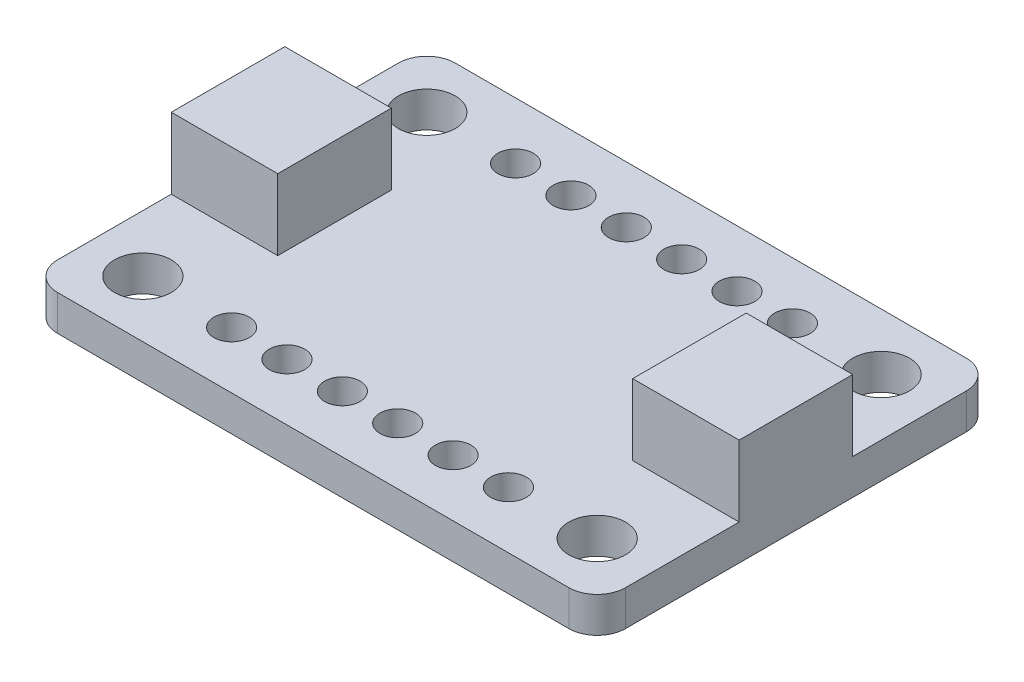
ISO-10303-21;
HEADER;
FILE_DESCRIPTION(('STEP AP214'),'2;1');
FILE_NAME('part.step','',(''),(''),'','','');
FILE_SCHEMA(('AUTOMOTIVE_DESIGN { 1 0 10303 214 1 1 1 1 }'));
ENDSEC;
DATA;
#1=APPLICATION_CONTEXT('core data for automotive mechanical design processes');
#2=APPLICATION_PROTOCOL_DEFINITION('international standard','automotive_design',2000,#1);
#3=PRODUCT_CONTEXT('',#1,'mechanical');
#4=PRODUCT('Part','Part','',(#3));
#5=PRODUCT_RELATED_PRODUCT_CATEGORY('part','',(#4));
#6=PRODUCT_DEFINITION_FORMATION('','',#4);
#7=PRODUCT_DEFINITION_CONTEXT('part definition',#1,'design');
#8=PRODUCT_DEFINITION('design','',#6,#7);
#9=PRODUCT_DEFINITION_SHAPE('','',#8);
#10=(LENGTH_UNIT() NAMED_UNIT(*) SI_UNIT(.MILLI.,.METRE.));
#11=(NAMED_UNIT(*) PLANE_ANGLE_UNIT() SI_UNIT($,.RADIAN.));
#12=(NAMED_UNIT(*) SI_UNIT($,.STERADIAN.) SOLID_ANGLE_UNIT());
#13=UNCERTAINTY_MEASURE_WITH_UNIT(LENGTH_MEASURE(1.E-05),#10,'distance_accuracy_value','');
#14=(GEOMETRIC_REPRESENTATION_CONTEXT(3) GLOBAL_UNCERTAINTY_ASSIGNED_CONTEXT((#13)) GLOBAL_UNIT_ASSIGNED_CONTEXT((#10,
#11,#12)) REPRESENTATION_CONTEXT('',''));
#15=CARTESIAN_POINT('',(0.,0.,0.));
#16=DIRECTION('',(0.,0.,1.));
#17=DIRECTION('',(1.,0.,0.));
#18=AXIS2_PLACEMENT_3D('',#15,#16,#17);
#19=CARTESIAN_POINT('',(1.27,1.5875,-16.51));
#20=DIRECTION('',(0.,-1.,0.));
#21=DIRECTION('',(0.,0.,-1.));
#22=AXIS2_PLACEMENT_3D('',#19,#20,#21);
#23=PLANE('',#22);
#24=CARTESIAN_POINT('',(11.46175,1.5875,-15.24));
#25=DIRECTION('',(0.,1.,0.));
#26=DIRECTION('',(0.,0.,1.));
#27=AXIS2_PLACEMENT_3D('',#24,#25,#26);
#28=CIRCLE('',#27,0.793749999999999);
#29=CARTESIAN_POINT('',(11.46175,1.5875,-14.44625));
#30=VERTEX_POINT('',#29);
#31=EDGE_CURVE('E244',#30,#30,#28,.T.);
#32=ORIENTED_EDGE('',*,*,#31,.F.);
#33=EDGE_LOOP('',(#32));
#34=FACE_BOUND('',#33,.T.);
#35=CARTESIAN_POINT('',(13.93825,1.5875,-15.24));
#36=DIRECTION('',(0.,1.,0.));
#37=DIRECTION('',(0.,0.,1.));
#38=AXIS2_PLACEMENT_3D('',#35,#36,#37);
#39=CIRCLE('',#38,0.793749999999999);
#40=CARTESIAN_POINT('',(13.93825,1.5875,-14.44625));
#41=VERTEX_POINT('',#40);
#42=EDGE_CURVE('E238',#41,#41,#39,.T.);
#43=ORIENTED_EDGE('',*,*,#42,.F.);
#44=EDGE_LOOP('',(#43));
#45=FACE_BOUND('',#44,.T.);
#46=CARTESIAN_POINT('',(16.41475,1.5875,-15.24));
#47=DIRECTION('',(0.,1.,0.));
#48=DIRECTION('',(0.,0.,1.));
#49=AXIS2_PLACEMENT_3D('',#46,#47,#48);
#50=CIRCLE('',#49,0.793749999999999);
#51=CARTESIAN_POINT('',(16.41475,1.5875,-14.44625));
#52=VERTEX_POINT('',#51);
#53=EDGE_CURVE('E232',#52,#52,#50,.T.);
#54=ORIENTED_EDGE('',*,*,#53,.F.);
#55=EDGE_LOOP('',(#54));
#56=FACE_BOUND('',#55,.T.);
#57=CARTESIAN_POINT('',(18.89125,1.5875,-2.54));
#58=DIRECTION('',(0.,1.,0.));
#59=DIRECTION('',(0.,0.,1.));
#60=AXIS2_PLACEMENT_3D('',#57,#58,#59);
#61=CIRCLE('',#60,0.793749999999999);
#62=CARTESIAN_POINT('',(18.89125,1.5875,-1.74625));
#63=VERTEX_POINT('',#62);
#64=EDGE_CURVE('E225',#63,#63,#61,.T.);
#65=ORIENTED_EDGE('',*,*,#64,.F.);
#66=EDGE_LOOP('',(#65));
#67=FACE_BOUND('',#66,.T.);
#68=CARTESIAN_POINT('',(16.41475,1.5875,-2.54));
#69=DIRECTION('',(0.,1.,0.));
#70=DIRECTION('',(0.,0.,1.));
#71=AXIS2_PLACEMENT_3D('',#68,#69,#70);
#72=CIRCLE('',#71,0.793749999999999);
#73=CARTESIAN_POINT('',(16.41475,1.5875,-1.74625));
#74=VERTEX_POINT('',#73);
#75=EDGE_CURVE('E268',#74,#74,#72,.T.);
#76=ORIENTED_EDGE('',*,*,#75,.F.);
#77=EDGE_LOOP('',(#76));
#78=FACE_BOUND('',#77,.T.);
#79=CARTESIAN_POINT('',(13.93825,1.5875,-2.54));
#80=DIRECTION('',(0.,1.,0.));
#81=DIRECTION('',(0.,0.,1.));
#82=AXIS2_PLACEMENT_3D('',#79,#80,#81);
#83=CIRCLE('',#82,0.793749999999999);
#84=CARTESIAN_POINT('',(13.93825,1.5875,-1.74625));
#85=VERTEX_POINT('',#84);
#86=EDGE_CURVE('E262',#85,#85,#83,.T.);
#87=ORIENTED_EDGE('',*,*,#86,.F.);
#88=EDGE_LOOP('',(#87));
#89=FACE_BOUND('',#88,.T.);
#90=CARTESIAN_POINT('',(11.46175,1.5875,-2.54));
#91=DIRECTION('',(0.,1.,0.));
#92=DIRECTION('',(0.,0.,1.));
#93=AXIS2_PLACEMENT_3D('',#90,#91,#92);
#94=CIRCLE('',#93,0.793749999999999);
#95=CARTESIAN_POINT('',(11.46175,1.5875,-1.74625));
#96=VERTEX_POINT('',#95);
#97=EDGE_CURVE('E256',#96,#96,#94,.T.);
#98=ORIENTED_EDGE('',*,*,#97,.F.);
#99=EDGE_LOOP('',(#98));
#100=FACE_BOUND('',#99,.T.);
#101=CARTESIAN_POINT('',(8.98525,1.5875,-2.54));
#102=DIRECTION('',(0.,1.,0.));
#103=DIRECTION('',(0.,0.,1.));
#104=AXIS2_PLACEMENT_3D('',#101,#102,#103);
#105=CIRCLE('',#104,0.793749999999999);
#106=CARTESIAN_POINT('',(8.98525,1.5875,-1.74625));
#107=VERTEX_POINT('',#106);
#108=EDGE_CURVE('E249',#107,#107,#105,.T.);
#109=ORIENTED_EDGE('',*,*,#108,.F.);
#110=EDGE_LOOP('',(#109));
#111=FACE_BOUND('',#110,.T.);
#112=CARTESIAN_POINT('',(8.98525,1.5875,-15.24));
#113=DIRECTION('',(0.,1.,0.));
#114=DIRECTION('',(0.,0.,1.));
#115=AXIS2_PLACEMENT_3D('',#112,#113,#114);
#116=CIRCLE('',#115,0.793749999999999);
#117=CARTESIAN_POINT('',(8.98525,1.5875,-14.44625));
#118=VERTEX_POINT('',#117);
#119=EDGE_CURVE('E207',#118,#118,#116,.T.);
#120=ORIENTED_EDGE('',*,*,#119,.F.);
#121=EDGE_LOOP('',(#120));
#122=FACE_BOUND('',#121,.T.);
#123=CARTESIAN_POINT('',(6.50875,1.5875,-15.24));
#124=DIRECTION('',(0.,1.,0.));
#125=DIRECTION('',(0.,0.,1.));
#126=AXIS2_PLACEMENT_3D('',#123,#124,#125);
#127=CIRCLE('',#126,0.79375);
#128=CARTESIAN_POINT('',(6.50875,1.5875,-14.44625));
#129=VERTEX_POINT('',#128);
#130=EDGE_CURVE('E214',#129,#129,#127,.T.);
#131=ORIENTED_EDGE('',*,*,#130,.F.);
#132=EDGE_LOOP('',(#131));
#133=FACE_BOUND('',#132,.T.);
#134=CARTESIAN_POINT('',(18.89125,1.5875,-15.24));
#135=DIRECTION('',(0.,1.,0.));
#136=DIRECTION('',(0.,0.,1.));
#137=AXIS2_PLACEMENT_3D('',#134,#135,#136);
#138=CIRCLE('',#137,0.793749999999999);
#139=CARTESIAN_POINT('',(18.89125,1.5875,-14.44625));
#140=VERTEX_POINT('',#139);
#141=EDGE_CURVE('E220',#140,#140,#138,.T.);
#142=ORIENTED_EDGE('',*,*,#141,.F.);
#143=EDGE_LOOP('',(#142));
#144=FACE_BOUND('',#143,.T.);
#145=CARTESIAN_POINT('',(6.50875,1.5875,-2.54));
#146=DIRECTION('',(0.,1.,0.));
#147=DIRECTION('',(0.,0.,1.));
#148=AXIS2_PLACEMENT_3D('',#145,#146,#147);
#149=CIRCLE('',#148,0.79375);
#150=CARTESIAN_POINT('',(6.50875,1.5875,-1.74625));
#151=VERTEX_POINT('',#150);
#152=EDGE_CURVE('E252',#151,#151,#149,.T.);
#153=ORIENTED_EDGE('',*,*,#152,.F.);
#154=EDGE_LOOP('',(#153));
#155=FACE_BOUND('',#154,.T.);
#156=CARTESIAN_POINT('',(2.54,1.5875,-15.24));
#157=DIRECTION('',(0.,1.,0.));
#158=DIRECTION('',(0.,0.,1.));
#159=AXIS2_PLACEMENT_3D('',#156,#157,#158);
#160=CIRCLE('',#159,1.27);
#161=CARTESIAN_POINT('',(2.54,1.5875,-13.97));
#162=VERTEX_POINT('',#161);
#163=EDGE_CURVE('E297',#162,#162,#160,.T.);
#164=ORIENTED_EDGE('',*,*,#163,.F.);
#165=EDGE_LOOP('',(#164));
#166=FACE_BOUND('',#165,.T.);
#167=CARTESIAN_POINT('',(22.86,1.5875,-15.24));
#168=DIRECTION('',(0.,1.,0.));
#169=DIRECTION('',(0.,0.,1.));
#170=AXIS2_PLACEMENT_3D('',#167,#168,#169);
#171=CIRCLE('',#170,1.27);
#172=CARTESIAN_POINT('',(22.86,1.5875,-13.97));
#173=VERTEX_POINT('',#172);
#174=EDGE_CURVE('E291',#173,#173,#171,.T.);
#175=ORIENTED_EDGE('',*,*,#174,.F.);
#176=EDGE_LOOP('',(#175));
#177=FACE_BOUND('',#176,.T.);
#178=CARTESIAN_POINT('',(22.86,1.5875,-2.54));
#179=DIRECTION('',(0.,1.,0.));
#180=DIRECTION('',(0.,0.,1.));
#181=AXIS2_PLACEMENT_3D('',#178,#179,#180);
#182=CIRCLE('',#181,1.27);
#183=CARTESIAN_POINT('',(22.86,1.5875,-1.27));
#184=VERTEX_POINT('',#183);
#185=EDGE_CURVE('E285',#184,#184,#182,.T.);
#186=ORIENTED_EDGE('',*,*,#185,.F.);
#187=EDGE_LOOP('',(#186));
#188=FACE_BOUND('',#187,.T.);
#189=CARTESIAN_POINT('',(2.54,1.5875,-2.54));
#190=DIRECTION('',(0.,1.,0.));
#191=DIRECTION('',(0.,0.,1.));
#192=AXIS2_PLACEMENT_3D('',#189,#190,#191);
#193=CIRCLE('',#192,1.27);
#194=CARTESIAN_POINT('',(2.54,1.5875,-1.27));
#195=VERTEX_POINT('',#194);
#196=EDGE_CURVE('E279',#195,#195,#193,.T.);
#197=ORIENTED_EDGE('',*,*,#196,.F.);
#198=EDGE_LOOP('',(#197));
#199=FACE_BOUND('',#198,.T.);
#200=DIRECTION('',(1.,0.,0.));
#201=VECTOR('',#200,1.);
#202=CARTESIAN_POINT('',(0.,1.5875,-6.35));
#203=LINE('',#202,#201);
#204=CARTESIAN_POINT('',(0.,1.5875,-6.35));
#205=VERTEX_POINT('',#204);
#206=CARTESIAN_POINT('',(4.7625,1.5875,-6.35));
#207=VERTEX_POINT('',#206);
#208=EDGE_CURVE('E376',#205,#207,#203,.T.);
#209=ORIENTED_EDGE('',*,*,#208,.F.);
#210=DIRECTION('',(0.,0.,1.));
#211=VECTOR('',#210,1.);
#212=CARTESIAN_POINT('',(0.,1.5875,-1.27));
#213=LINE('',#212,#211);
#214=CARTESIAN_POINT('',(0.,1.5875,-1.27));
#215=VERTEX_POINT('',#214);
#216=EDGE_CURVE('E170',#205,#215,#213,.T.);
#217=ORIENTED_EDGE('',*,*,#216,.T.);
#218=CARTESIAN_POINT('',(1.27,1.5875,-1.27));
#219=DIRECTION('',(0.,1.,0.));
#220=DIRECTION('',(0.,0.,1.));
#221=AXIS2_PLACEMENT_3D('',#218,#219,#220);
#222=CIRCLE('',#221,1.27);
#223=CARTESIAN_POINT('',(1.27,1.5875,0.));
#224=VERTEX_POINT('',#223);
#225=EDGE_CURVE('E309',#215,#224,#222,.T.);
#226=ORIENTED_EDGE('',*,*,#225,.T.);
#227=DIRECTION('',(1.,0.,0.));
#228=VECTOR('',#227,1.);
#229=CARTESIAN_POINT('',(1.27,1.5875,0.));
#230=LINE('',#229,#228);
#231=CARTESIAN_POINT('',(24.13,1.5875,0.));
#232=VERTEX_POINT('',#231);
#233=EDGE_CURVE('E311',#224,#232,#230,.T.);
#234=ORIENTED_EDGE('',*,*,#233,.T.);
#235=CARTESIAN_POINT('',(24.13,1.5875,-1.27));
#236=DIRECTION('',(0.,1.,0.));
#237=DIRECTION('',(0.,0.,1.));
#238=AXIS2_PLACEMENT_3D('',#235,#236,#237);
#239=CIRCLE('',#238,1.27);
#240=CARTESIAN_POINT('',(25.4,1.5875,-1.27));
#241=VERTEX_POINT('',#240);
#242=EDGE_CURVE('E313',#232,#241,#239,.T.);
#243=ORIENTED_EDGE('',*,*,#242,.T.);
#244=DIRECTION('',(0.,0.,-1.));
#245=VECTOR('',#244,1.);
#246=CARTESIAN_POINT('',(25.4,1.5875,-1.27));
#247=LINE('',#246,#245);
#248=CARTESIAN_POINT('',(25.4,1.5875,-6.35));
#249=VERTEX_POINT('',#248);
#250=EDGE_CURVE('E316',#241,#249,#247,.T.);
#251=ORIENTED_EDGE('',*,*,#250,.T.);
#252=DIRECTION('',(1.,0.,0.));
#253=VECTOR('',#252,1.);
#254=CARTESIAN_POINT('',(25.4,1.5875,-6.35));
#255=LINE('',#254,#253);
#256=CARTESIAN_POINT('',(20.6375,1.5875,-6.35));
#257=VERTEX_POINT('',#256);
#258=EDGE_CURVE('E184',#257,#249,#255,.T.);
#259=ORIENTED_EDGE('',*,*,#258,.F.);
#260=DIRECTION('',(0.,0.,1.));
#261=VECTOR('',#260,1.);
#262=CARTESIAN_POINT('',(20.6375,1.5875,-6.35));
#263=LINE('',#262,#261);
#264=CARTESIAN_POINT('',(20.6375,1.5875,-11.43));
#265=VERTEX_POINT('',#264);
#266=EDGE_CURVE('E174',#265,#257,#263,.T.);
#267=ORIENTED_EDGE('',*,*,#266,.F.);
#268=DIRECTION('',(-1.,0.,0.));
#269=VECTOR('',#268,1.);
#270=CARTESIAN_POINT('',(25.4,1.5875,-11.43));
#271=LINE('',#270,#269);
#272=CARTESIAN_POINT('',(25.4,1.5875,-11.43));
#273=VERTEX_POINT('',#272);
#274=EDGE_CURVE('E171',#273,#265,#271,.T.);
#275=ORIENTED_EDGE('',*,*,#274,.F.);
#276=CARTESIAN_POINT('',(25.4,1.5875,-16.51));
#277=VERTEX_POINT('',#276);
#278=EDGE_CURVE('E315',#273,#277,#247,.T.);
#279=ORIENTED_EDGE('',*,*,#278,.T.);
#280=CARTESIAN_POINT('',(24.13,1.5875,-16.51));
#281=DIRECTION('',(0.,1.,0.));
#282=DIRECTION('',(0.,0.,1.));
#283=AXIS2_PLACEMENT_3D('',#280,#281,#282);
#284=CIRCLE('',#283,1.27);
#285=CARTESIAN_POINT('',(24.13,1.5875,-17.78));
#286=VERTEX_POINT('',#285);
#287=EDGE_CURVE('E318',#277,#286,#284,.T.);
#288=ORIENTED_EDGE('',*,*,#287,.T.);
#289=DIRECTION('',(-1.,0.,0.));
#290=VECTOR('',#289,1.);
#291=CARTESIAN_POINT('',(1.27,1.5875,-17.78));
#292=LINE('',#291,#290);
#293=CARTESIAN_POINT('',(1.27,1.5875,-17.78));
#294=VERTEX_POINT('',#293);
#295=EDGE_CURVE('E320',#286,#294,#292,.T.);
#296=ORIENTED_EDGE('',*,*,#295,.T.);
#297=CARTESIAN_POINT('',(1.27,1.5875,-16.51));
#298=DIRECTION('',(0.,1.,0.));
#299=DIRECTION('',(0.,0.,-1.));
#300=AXIS2_PLACEMENT_3D('',#297,#298,#299);
#301=CIRCLE('',#300,1.27);
#302=CARTESIAN_POINT('',(0.,1.5875,-16.51));
#303=VERTEX_POINT('',#302);
#304=EDGE_CURVE('E303',#294,#303,#301,.T.);
#305=ORIENTED_EDGE('',*,*,#304,.T.);
#306=CARTESIAN_POINT('',(0.,1.5875,-11.43));
#307=VERTEX_POINT('',#306);
#308=EDGE_CURVE('E307',#303,#307,#213,.T.);
#309=ORIENTED_EDGE('',*,*,#308,.T.);
#310=DIRECTION('',(-1.,0.,0.));
#311=VECTOR('',#310,1.);
#312=CARTESIAN_POINT('',(0.,1.5875,-11.43));
#313=LINE('',#312,#311);
#314=CARTESIAN_POINT('',(4.7625,1.5875,-11.43));
#315=VERTEX_POINT('',#314);
#316=EDGE_CURVE('E56',#315,#307,#313,.T.);
#317=ORIENTED_EDGE('',*,*,#316,.F.);
#318=DIRECTION('',(0.,0.,-1.));
#319=VECTOR('',#318,1.);
#320=CARTESIAN_POINT('',(4.7625,1.5875,-6.35));
#321=LINE('',#320,#319);
#322=EDGE_CURVE('E51',#207,#315,#321,.T.);
#323=ORIENTED_EDGE('',*,*,#322,.F.);
#324=EDGE_LOOP('',(#209,#217,#226,#234,#243,#251,#259,#267,#275,#279,#288,#296,#305,#309,#317,#323));
#325=FACE_BOUND('',#324,.T.);
#326=ADVANCED_FACE('F36',(#34,#45,#56,#67,#78,#89,#100,#111,#122,#133,#144,#155,#166,#177,#188,
#199,#325),#23,.F.);
#327=CARTESIAN_POINT('',(1.27,0.,-16.51));
#328=DIRECTION('',(0.,-1.,0.));
#329=DIRECTION('',(0.,0.,-1.));
#330=AXIS2_PLACEMENT_3D('',#327,#328,#329);
#331=PLANE('',#330);
#332=CARTESIAN_POINT('',(11.46175,0.,-15.24));
#333=DIRECTION('',(0.,1.,0.));
#334=DIRECTION('',(0.,0.,1.));
#335=AXIS2_PLACEMENT_3D('',#332,#333,#334);
#336=CIRCLE('',#335,0.793749999999999);
#337=CARTESIAN_POINT('',(11.46175,0.,-14.44625));
#338=VERTEX_POINT('',#337);
#339=EDGE_CURVE('E210',#338,#338,#336,.T.);
#340=ORIENTED_EDGE('',*,*,#339,.T.);
#341=EDGE_LOOP('',(#340));
#342=FACE_BOUND('',#341,.T.);
#343=CARTESIAN_POINT('',(13.93825,0.,-15.24));
#344=DIRECTION('',(0.,1.,0.));
#345=DIRECTION('',(0.,0.,1.));
#346=AXIS2_PLACEMENT_3D('',#343,#344,#345);
#347=CIRCLE('',#346,0.793749999999999);
#348=CARTESIAN_POINT('',(13.93825,0.,-14.44625));
#349=VERTEX_POINT('',#348);
#350=EDGE_CURVE('E241',#349,#349,#347,.T.);
#351=ORIENTED_EDGE('',*,*,#350,.T.);
#352=EDGE_LOOP('',(#351));
#353=FACE_BOUND('',#352,.T.);
#354=CARTESIAN_POINT('',(16.41475,0.,-15.24));
#355=DIRECTION('',(0.,1.,0.));
#356=DIRECTION('',(0.,0.,1.));
#357=AXIS2_PLACEMENT_3D('',#354,#355,#356);
#358=CIRCLE('',#357,0.793749999999999);
#359=CARTESIAN_POINT('',(16.41475,0.,-14.44625));
#360=VERTEX_POINT('',#359);
#361=EDGE_CURVE('E235',#360,#360,#358,.T.);
#362=ORIENTED_EDGE('',*,*,#361,.T.);
#363=EDGE_LOOP('',(#362));
#364=FACE_BOUND('',#363,.T.);
#365=CARTESIAN_POINT('',(18.89125,0.,-2.54));
#366=DIRECTION('',(0.,1.,0.));
#367=DIRECTION('',(0.,0.,1.));
#368=AXIS2_PLACEMENT_3D('',#365,#366,#367);
#369=CIRCLE('',#368,0.793749999999999);
#370=CARTESIAN_POINT('',(18.89125,0.,-1.74625));
#371=VERTEX_POINT('',#370);
#372=EDGE_CURVE('E229',#371,#371,#369,.T.);
#373=ORIENTED_EDGE('',*,*,#372,.T.);
#374=EDGE_LOOP('',(#373));
#375=FACE_BOUND('',#374,.T.);
#376=CARTESIAN_POINT('',(16.41475,0.,-2.54));
#377=DIRECTION('',(0.,1.,0.));
#378=DIRECTION('',(0.,0.,1.));
#379=AXIS2_PLACEMENT_3D('',#376,#377,#378);
#380=CIRCLE('',#379,0.793749999999999);
#381=CARTESIAN_POINT('',(16.41475,0.,-1.74625));
#382=VERTEX_POINT('',#381);
#383=EDGE_CURVE('E228',#382,#382,#380,.T.);
#384=ORIENTED_EDGE('',*,*,#383,.T.);
#385=EDGE_LOOP('',(#384));
#386=FACE_BOUND('',#385,.T.);
#387=CARTESIAN_POINT('',(13.93825,0.,-2.54));
#388=DIRECTION('',(0.,1.,0.));
#389=DIRECTION('',(0.,0.,1.));
#390=AXIS2_PLACEMENT_3D('',#387,#388,#389);
#391=CIRCLE('',#390,0.793749999999999);
#392=CARTESIAN_POINT('',(13.93825,0.,-1.74625));
#393=VERTEX_POINT('',#392);
#394=EDGE_CURVE('E265',#393,#393,#391,.T.);
#395=ORIENTED_EDGE('',*,*,#394,.T.);
#396=EDGE_LOOP('',(#395));
#397=FACE_BOUND('',#396,.T.);
#398=CARTESIAN_POINT('',(11.46175,0.,-2.54));
#399=DIRECTION('',(0.,1.,0.));
#400=DIRECTION('',(0.,0.,1.));
#401=AXIS2_PLACEMENT_3D('',#398,#399,#400);
#402=CIRCLE('',#401,0.793749999999999);
#403=CARTESIAN_POINT('',(11.46175,0.,-1.74625));
#404=VERTEX_POINT('',#403);
#405=EDGE_CURVE('E259',#404,#404,#402,.T.);
#406=ORIENTED_EDGE('',*,*,#405,.T.);
#407=EDGE_LOOP('',(#406));
#408=FACE_BOUND('',#407,.T.);
#409=CARTESIAN_POINT('',(8.98525,0.,-2.54));
#410=DIRECTION('',(0.,1.,0.));
#411=DIRECTION('',(0.,0.,1.));
#412=AXIS2_PLACEMENT_3D('',#409,#410,#411);
#413=CIRCLE('',#412,0.793749999999999);
#414=CARTESIAN_POINT('',(8.98525,0.,-1.74625));
#415=VERTEX_POINT('',#414);
#416=EDGE_CURVE('E253',#415,#415,#413,.T.);
#417=ORIENTED_EDGE('',*,*,#416,.T.);
#418=EDGE_LOOP('',(#417));
#419=FACE_BOUND('',#418,.T.);
#420=CARTESIAN_POINT('',(8.98525,0.,-15.24));
#421=DIRECTION('',(0.,1.,0.));
#422=DIRECTION('',(0.,0.,1.));
#423=AXIS2_PLACEMENT_3D('',#420,#421,#422);
#424=CIRCLE('',#423,0.793749999999999);
#425=CARTESIAN_POINT('',(8.98525,0.,-14.44625));
#426=VERTEX_POINT('',#425);
#427=EDGE_CURVE('E211',#426,#426,#424,.T.);
#428=ORIENTED_EDGE('',*,*,#427,.T.);
#429=EDGE_LOOP('',(#428));
#430=FACE_BOUND('',#429,.T.);
#431=CARTESIAN_POINT('',(6.50875,0.,-15.24));
#432=DIRECTION('',(0.,1.,0.));
#433=DIRECTION('',(0.,0.,1.));
#434=AXIS2_PLACEMENT_3D('',#431,#432,#433);
#435=CIRCLE('',#434,0.79375);
#436=CARTESIAN_POINT('',(6.50875,0.,-14.44625));
#437=VERTEX_POINT('',#436);
#438=EDGE_CURVE('E217',#437,#437,#435,.T.);
#439=ORIENTED_EDGE('',*,*,#438,.T.);
#440=EDGE_LOOP('',(#439));
#441=FACE_BOUND('',#440,.T.);
#442=CARTESIAN_POINT('',(18.89125,0.,-15.24));
#443=DIRECTION('',(0.,1.,0.));
#444=DIRECTION('',(0.,0.,1.));
#445=AXIS2_PLACEMENT_3D('',#442,#443,#444);
#446=CIRCLE('',#445,0.793749999999999);
#447=CARTESIAN_POINT('',(18.89125,0.,-14.44625));
#448=VERTEX_POINT('',#447);
#449=EDGE_CURVE('E206',#448,#448,#446,.T.);
#450=ORIENTED_EDGE('',*,*,#449,.T.);
#451=EDGE_LOOP('',(#450));
#452=FACE_BOUND('',#451,.T.);
#453=CARTESIAN_POINT('',(6.50875,0.,-2.54));
#454=DIRECTION('',(0.,1.,0.));
#455=DIRECTION('',(0.,0.,1.));
#456=AXIS2_PLACEMENT_3D('',#453,#454,#455);
#457=CIRCLE('',#456,0.79375);
#458=CARTESIAN_POINT('',(6.50875,0.,-1.74625));
#459=VERTEX_POINT('',#458);
#460=EDGE_CURVE('E273',#459,#459,#457,.T.);
#461=ORIENTED_EDGE('',*,*,#460,.T.);
#462=EDGE_LOOP('',(#461));
#463=FACE_BOUND('',#462,.T.);
#464=CARTESIAN_POINT('',(22.86,0.,-2.54));
#465=DIRECTION('',(0.,1.,0.));
#466=DIRECTION('',(0.,0.,1.));
#467=AXIS2_PLACEMENT_3D('',#464,#465,#466);
#468=CIRCLE('',#467,1.27);
#469=CARTESIAN_POINT('',(22.86,0.,-1.27));
#470=VERTEX_POINT('',#469);
#471=EDGE_CURVE('E282',#470,#470,#468,.T.);
#472=ORIENTED_EDGE('',*,*,#471,.T.);
#473=EDGE_LOOP('',(#472));
#474=FACE_BOUND('',#473,.T.);
#475=CARTESIAN_POINT('',(2.54,0.,-15.24));
#476=DIRECTION('',(0.,1.,0.));
#477=DIRECTION('',(0.,0.,1.));
#478=AXIS2_PLACEMENT_3D('',#475,#476,#477);
#479=CIRCLE('',#478,1.27);
#480=CARTESIAN_POINT('',(2.54,0.,-13.97));
#481=VERTEX_POINT('',#480);
#482=EDGE_CURVE('E294',#481,#481,#479,.T.);
#483=ORIENTED_EDGE('',*,*,#482,.T.);
#484=EDGE_LOOP('',(#483));
#485=FACE_BOUND('',#484,.T.);
#486=CARTESIAN_POINT('',(1.27,0.,-16.51));
#487=DIRECTION('',(0.,1.,0.));
#488=DIRECTION('',(0.,0.,-1.));
#489=AXIS2_PLACEMENT_3D('',#486,#487,#488);
#490=CIRCLE('',#489,1.27);
#491=CARTESIAN_POINT('',(1.27,0.,-17.78));
#492=VERTEX_POINT('',#491);
#493=CARTESIAN_POINT('',(0.,0.,-16.51));
#494=VERTEX_POINT('',#493);
#495=EDGE_CURVE('E300',#492,#494,#490,.T.);
#496=ORIENTED_EDGE('',*,*,#495,.F.);
#497=DIRECTION('',(-1.,0.,0.));
#498=VECTOR('',#497,1.);
#499=CARTESIAN_POINT('',(1.27,0.,-17.78));
#500=LINE('',#499,#498);
#501=CARTESIAN_POINT('',(24.13,0.,-17.78));
#502=VERTEX_POINT('',#501);
#503=EDGE_CURVE('E306',#502,#492,#500,.T.);
#504=ORIENTED_EDGE('',*,*,#503,.F.);
#505=CARTESIAN_POINT('',(24.13,0.,-16.51));
#506=DIRECTION('',(0.,1.,0.));
#507=DIRECTION('',(0.,0.,1.));
#508=AXIS2_PLACEMENT_3D('',#505,#506,#507);
#509=CIRCLE('',#508,1.27);
#510=CARTESIAN_POINT('',(25.4,0.,-16.51));
#511=VERTEX_POINT('',#510);
#512=EDGE_CURVE('E335',#511,#502,#509,.T.);
#513=ORIENTED_EDGE('',*,*,#512,.F.);
#514=DIRECTION('',(0.,0.,-1.));
#515=VECTOR('',#514,1.);
#516=CARTESIAN_POINT('',(25.4,0.,-1.27));
#517=LINE('',#516,#515);
#518=CARTESIAN_POINT('',(25.4,0.,-1.27));
#519=VERTEX_POINT('',#518);
#520=EDGE_CURVE('E333',#519,#511,#517,.T.);
#521=ORIENTED_EDGE('',*,*,#520,.F.);
#522=CARTESIAN_POINT('',(24.13,0.,-1.27));
#523=DIRECTION('',(0.,1.,0.));
#524=DIRECTION('',(0.,0.,1.));
#525=AXIS2_PLACEMENT_3D('',#522,#523,#524);
#526=CIRCLE('',#525,1.27);
#527=CARTESIAN_POINT('',(24.13,0.,0.));
#528=VERTEX_POINT('',#527);
#529=EDGE_CURVE('E331',#528,#519,#526,.T.);
#530=ORIENTED_EDGE('',*,*,#529,.F.);
#531=DIRECTION('',(1.,0.,0.));
#532=VECTOR('',#531,1.);
#533=CARTESIAN_POINT('',(1.27,0.,0.));
#534=LINE('',#533,#532);
#535=CARTESIAN_POINT('',(1.27,0.,0.));
#536=VERTEX_POINT('',#535);
#537=EDGE_CURVE('E329',#536,#528,#534,.T.);
#538=ORIENTED_EDGE('',*,*,#537,.F.);
#539=CARTESIAN_POINT('',(1.27,0.,-1.27));
#540=DIRECTION('',(0.,1.,0.));
#541=DIRECTION('',(0.,0.,1.));
#542=AXIS2_PLACEMENT_3D('',#539,#540,#541);
#543=CIRCLE('',#542,1.27);
#544=CARTESIAN_POINT('',(0.,0.,-1.27));
#545=VERTEX_POINT('',#544);
#546=EDGE_CURVE('E327',#545,#536,#543,.T.);
#547=ORIENTED_EDGE('',*,*,#546,.F.);
#548=DIRECTION('',(0.,0.,1.));
#549=VECTOR('',#548,1.);
#550=CARTESIAN_POINT('',(0.,0.,-1.27));
#551=LINE('',#550,#549);
#552=EDGE_CURVE('E325',#494,#545,#551,.T.);
#553=ORIENTED_EDGE('',*,*,#552,.F.);
#554=EDGE_LOOP('',(#496,#504,#513,#521,#530,#538,#547,#553));
#555=FACE_BOUND('',#554,.T.);
#556=CARTESIAN_POINT('',(22.86,0.,-15.24));
#557=DIRECTION('',(0.,1.,0.));
#558=DIRECTION('',(0.,0.,1.));
#559=AXIS2_PLACEMENT_3D('',#556,#557,#558);
#560=CIRCLE('',#559,1.27);
#561=CARTESIAN_POINT('',(22.86,0.,-13.97));
#562=VERTEX_POINT('',#561);
#563=EDGE_CURVE('E288',#562,#562,#560,.T.);
#564=ORIENTED_EDGE('',*,*,#563,.T.);
#565=EDGE_LOOP('',(#564));
#566=FACE_BOUND('',#565,.T.);
#567=CARTESIAN_POINT('',(2.54,0.,-2.54));
#568=DIRECTION('',(0.,1.,0.));
#569=DIRECTION('',(0.,0.,1.));
#570=AXIS2_PLACEMENT_3D('',#567,#568,#569);
#571=CIRCLE('',#570,1.27);
#572=CARTESIAN_POINT('',(2.54,0.,-1.27));
#573=VERTEX_POINT('',#572);
#574=EDGE_CURVE('E276',#573,#573,#571,.T.);
#575=ORIENTED_EDGE('',*,*,#574,.T.);
#576=EDGE_LOOP('',(#575));
#577=FACE_BOUND('',#576,.T.);
#578=ADVANCED_FACE('F363',(#342,#353,#364,#375,#386,#397,#408,#419,#430,#441,#452,#463,#474,
#485,#555,#566,#577),#331,.T.);
#579=CARTESIAN_POINT('',(1.27,1.5875,-16.51));
#580=DIRECTION('',(0.,-1.,0.));
#581=DIRECTION('',(0.,0.,-1.));
#582=AXIS2_PLACEMENT_3D('',#579,#580,#581);
#583=CYLINDRICAL_SURFACE('',#582,1.27);
#584=ORIENTED_EDGE('',*,*,#495,.T.);
#585=DIRECTION('',(0.,-1.,0.));
#586=VECTOR('',#585,1.);
#587=CARTESIAN_POINT('',(0.,1.5875,-16.51));
#588=LINE('',#587,#586);
#589=EDGE_CURVE('E11',#303,#494,#588,.T.);
#590=ORIENTED_EDGE('',*,*,#589,.F.);
#591=ORIENTED_EDGE('',*,*,#304,.F.);
#592=DIRECTION('',(0.,-1.,0.));
#593=VECTOR('',#592,1.);
#594=CARTESIAN_POINT('',(1.27,1.5875,-17.78));
#595=LINE('',#594,#593);
#596=EDGE_CURVE('E322',#294,#492,#595,.T.);
#597=ORIENTED_EDGE('',*,*,#596,.T.);
#598=EDGE_LOOP('',(#584,#590,#591,#597));
#599=FACE_BOUND('',#598,.T.);
#600=ADVANCED_FACE('F38',(#599),#583,.T.);
#601=CARTESIAN_POINT('',(0.,1.5875,-1.27));
#602=DIRECTION('',(1.,0.,0.));
#603=DIRECTION('',(0.,0.,-1.));
#604=AXIS2_PLACEMENT_3D('',#601,#602,#603);
#605=PLANE('',#604);
#606=ORIENTED_EDGE('',*,*,#552,.T.);
#607=DIRECTION('',(0.,-1.,0.));
#608=VECTOR('',#607,1.);
#609=CARTESIAN_POINT('',(0.,1.5875,-1.27));
#610=LINE('',#609,#608);
#611=EDGE_CURVE('E44',#215,#545,#610,.T.);
#612=ORIENTED_EDGE('',*,*,#611,.F.);
#613=ORIENTED_EDGE('',*,*,#216,.F.);
#614=DIRECTION('',(0.,-1.,0.));
#615=VECTOR('',#614,1.);
#616=CARTESIAN_POINT('',(0.,4.7625,-6.35));
#617=LINE('',#616,#615);
#618=CARTESIAN_POINT('',(0.,4.7625,-6.35));
#619=VERTEX_POINT('',#618);
#620=EDGE_CURVE('E152',#619,#205,#617,.T.);
#621=ORIENTED_EDGE('',*,*,#620,.F.);
#622=DIRECTION('',(0.,0.,1.));
#623=VECTOR('',#622,1.);
#624=CARTESIAN_POINT('',(0.,4.7625,-6.35));
#625=LINE('',#624,#623);
#626=CARTESIAN_POINT('',(0.,4.7625,-11.43));
#627=VERTEX_POINT('',#626);
#628=EDGE_CURVE('E158',#627,#619,#625,.T.);
#629=ORIENTED_EDGE('',*,*,#628,.F.);
#630=DIRECTION('',(0.,-1.,0.));
#631=VECTOR('',#630,1.);
#632=CARTESIAN_POINT('',(0.,4.7625,-11.43));
#633=LINE('',#632,#631);
#634=EDGE_CURVE('E383',#627,#307,#633,.T.);
#635=ORIENTED_EDGE('',*,*,#634,.T.);
#636=ORIENTED_EDGE('',*,*,#308,.F.);
#637=ORIENTED_EDGE('',*,*,#589,.T.);
#638=EDGE_LOOP('',(#606,#612,#613,#621,#629,#635,#636,#637));
#639=FACE_BOUND('',#638,.T.);
#640=ADVANCED_FACE('F168',(#639),#605,.F.);
#641=CARTESIAN_POINT('',(1.27,1.5875,-1.27));
#642=DIRECTION('',(0.,-1.,0.));
#643=DIRECTION('',(0.,0.,-1.));
#644=AXIS2_PLACEMENT_3D('',#641,#642,#643);
#645=CYLINDRICAL_SURFACE('',#644,1.27);
#646=ORIENTED_EDGE('',*,*,#546,.T.);
#647=DIRECTION('',(0.,-1.,0.));
#648=VECTOR('',#647,1.);
#649=CARTESIAN_POINT('',(1.27,1.5875,0.));
#650=LINE('',#649,#648);
#651=EDGE_CURVE('E352',#224,#536,#650,.T.);
#652=ORIENTED_EDGE('',*,*,#651,.F.);
#653=ORIENTED_EDGE('',*,*,#225,.F.);
#654=ORIENTED_EDGE('',*,*,#611,.T.);
#655=EDGE_LOOP('',(#646,#652,#653,#654));
#656=FACE_BOUND('',#655,.T.);
#657=ADVANCED_FACE('F358',(#656),#645,.T.);
#658=CARTESIAN_POINT('',(1.27,1.5875,0.));
#659=DIRECTION('',(0.,0.,-1.));
#660=DIRECTION('',(-1.,0.,0.));
#661=AXIS2_PLACEMENT_3D('',#658,#659,#660);
#662=PLANE('',#661);
#663=ORIENTED_EDGE('',*,*,#537,.T.);
#664=DIRECTION('',(0.,-1.,0.));
#665=VECTOR('',#664,1.);
#666=CARTESIAN_POINT('',(24.13,1.5875,0.));
#667=LINE('',#666,#665);
#668=EDGE_CURVE('E349',#232,#528,#667,.T.);
#669=ORIENTED_EDGE('',*,*,#668,.F.);
#670=ORIENTED_EDGE('',*,*,#233,.F.);
#671=ORIENTED_EDGE('',*,*,#651,.T.);
#672=EDGE_LOOP('',(#663,#669,#670,#671));
#673=FACE_BOUND('',#672,.T.);
#674=ADVANCED_FACE('F369',(#673),#662,.F.);
#675=CARTESIAN_POINT('',(24.13,1.5875,-1.27));
#676=DIRECTION('',(0.,-1.,0.));
#677=DIRECTION('',(0.,0.,-1.));
#678=AXIS2_PLACEMENT_3D('',#675,#676,#677);
#679=CYLINDRICAL_SURFACE('',#678,1.27);
#680=ORIENTED_EDGE('',*,*,#529,.T.);
#681=DIRECTION('',(0.,-1.,0.));
#682=VECTOR('',#681,1.);
#683=CARTESIAN_POINT('',(25.4,1.5875,-1.27));
#684=LINE('',#683,#682);
#685=EDGE_CURVE('E346',#241,#519,#684,.T.);
#686=ORIENTED_EDGE('',*,*,#685,.F.);
#687=ORIENTED_EDGE('',*,*,#242,.F.);
#688=ORIENTED_EDGE('',*,*,#668,.T.);
#689=EDGE_LOOP('',(#680,#686,#687,#688));
#690=FACE_BOUND('',#689,.T.);
#691=ADVANCED_FACE('F373',(#690),#679,.T.);
#692=CARTESIAN_POINT('',(25.4,1.5875,-1.27));
#693=DIRECTION('',(-1.,0.,0.));
#694=DIRECTION('',(0.,0.,1.));
#695=AXIS2_PLACEMENT_3D('',#692,#693,#694);
#696=PLANE('',#695);
#697=ORIENTED_EDGE('',*,*,#520,.T.);
#698=DIRECTION('',(0.,-1.,0.));
#699=VECTOR('',#698,1.);
#700=CARTESIAN_POINT('',(25.4,1.5875,-16.51));
#701=LINE('',#700,#699);
#702=EDGE_CURVE('E343',#277,#511,#701,.T.);
#703=ORIENTED_EDGE('',*,*,#702,.F.);
#704=ORIENTED_EDGE('',*,*,#278,.F.);
#705=DIRECTION('',(0.,-1.,0.));
#706=VECTOR('',#705,1.);
#707=CARTESIAN_POINT('',(25.4,4.7625,-11.43));
#708=LINE('',#707,#706);
#709=CARTESIAN_POINT('',(25.4,4.7625,-11.43));
#710=VERTEX_POINT('',#709);
#711=EDGE_CURVE('E203',#710,#273,#708,.T.);
#712=ORIENTED_EDGE('',*,*,#711,.F.);
#713=DIRECTION('',(0.,0.,-1.));
#714=VECTOR('',#713,1.);
#715=CARTESIAN_POINT('',(25.4,4.7625,-6.35));
#716=LINE('',#715,#714);
#717=CARTESIAN_POINT('',(25.4,4.7625,-6.35));
#718=VERTEX_POINT('',#717);
#719=EDGE_CURVE('E180',#718,#710,#716,.T.);
#720=ORIENTED_EDGE('',*,*,#719,.F.);
#721=DIRECTION('',(0.,-1.,0.));
#722=VECTOR('',#721,1.);
#723=CARTESIAN_POINT('',(25.4,4.7625,-6.35));
#724=LINE('',#723,#722);
#725=EDGE_CURVE('E189',#718,#249,#724,.T.);
#726=ORIENTED_EDGE('',*,*,#725,.T.);
#727=ORIENTED_EDGE('',*,*,#250,.F.);
#728=ORIENTED_EDGE('',*,*,#685,.T.);
#729=EDGE_LOOP('',(#697,#703,#704,#712,#720,#726,#727,#728));
#730=FACE_BOUND('',#729,.T.);
#731=ADVANCED_FACE('F420',(#730),#696,.F.);
#732=CARTESIAN_POINT('',(24.13,1.5875,-16.51));
#733=DIRECTION('',(0.,-1.,0.));
#734=DIRECTION('',(0.,0.,-1.));
#735=AXIS2_PLACEMENT_3D('',#732,#733,#734);
#736=CYLINDRICAL_SURFACE('',#735,1.27);
#737=ORIENTED_EDGE('',*,*,#512,.T.);
#738=DIRECTION('',(0.,-1.,0.));
#739=VECTOR('',#738,1.);
#740=CARTESIAN_POINT('',(24.13,1.5875,-17.78));
#741=LINE('',#740,#739);
#742=EDGE_CURVE('E340',#286,#502,#741,.T.);
#743=ORIENTED_EDGE('',*,*,#742,.F.);
#744=ORIENTED_EDGE('',*,*,#287,.F.);
#745=ORIENTED_EDGE('',*,*,#702,.T.);
#746=EDGE_LOOP('',(#737,#743,#744,#745));
#747=FACE_BOUND('',#746,.T.);
#748=ADVANCED_FACE('F416',(#747),#736,.T.);
#749=CARTESIAN_POINT('',(1.27,1.5875,-17.78));
#750=DIRECTION('',(0.,0.,1.));
#751=DIRECTION('',(1.,0.,0.));
#752=AXIS2_PLACEMENT_3D('',#749,#750,#751);
#753=PLANE('',#752);
#754=ORIENTED_EDGE('',*,*,#503,.T.);
#755=ORIENTED_EDGE('',*,*,#596,.F.);
#756=ORIENTED_EDGE('',*,*,#295,.F.);
#757=ORIENTED_EDGE('',*,*,#742,.T.);
#758=EDGE_LOOP('',(#754,#755,#756,#757));
#759=FACE_BOUND('',#758,.T.);
#760=ADVANCED_FACE('F413',(#759),#753,.F.);
#761=CARTESIAN_POINT('',(2.54,1.5875,-15.24));
#762=DIRECTION('',(0.,-1.,0.));
#763=DIRECTION('',(0.,0.,-1.));
#764=AXIS2_PLACEMENT_3D('',#761,#762,#763);
#765=CYLINDRICAL_SURFACE('',#764,1.27);
#766=ORIENTED_EDGE('',*,*,#163,.T.);
#767=EDGE_LOOP('',(#766));
#768=FACE_BOUND('',#767,.T.);
#769=ORIENTED_EDGE('',*,*,#482,.F.);
#770=EDGE_LOOP('',(#769));
#771=FACE_BOUND('',#770,.T.);
#772=ADVANCED_FACE('F410',(#768,#771),#765,.F.);
#773=CARTESIAN_POINT('',(22.86,1.5875,-15.24));
#774=DIRECTION('',(0.,-1.,0.));
#775=DIRECTION('',(0.,0.,-1.));
#776=AXIS2_PLACEMENT_3D('',#773,#774,#775);
#777=CYLINDRICAL_SURFACE('',#776,1.27);
#778=ORIENTED_EDGE('',*,*,#174,.T.);
#779=EDGE_LOOP('',(#778));
#780=FACE_BOUND('',#779,.T.);
#781=ORIENTED_EDGE('',*,*,#563,.F.);
#782=EDGE_LOOP('',(#781));
#783=FACE_BOUND('',#782,.T.);
#784=ADVANCED_FACE('F526',(#780,#783),#777,.F.);
#785=CARTESIAN_POINT('',(22.86,1.5875,-2.54));
#786=DIRECTION('',(0.,-1.,0.));
#787=DIRECTION('',(0.,0.,-1.));
#788=AXIS2_PLACEMENT_3D('',#785,#786,#787);
#789=CYLINDRICAL_SURFACE('',#788,1.27);
#790=ORIENTED_EDGE('',*,*,#185,.T.);
#791=EDGE_LOOP('',(#790));
#792=FACE_BOUND('',#791,.T.);
#793=ORIENTED_EDGE('',*,*,#471,.F.);
#794=EDGE_LOOP('',(#793));
#795=FACE_BOUND('',#794,.T.);
#796=ADVANCED_FACE('F523',(#792,#795),#789,.F.);
#797=CARTESIAN_POINT('',(2.54,1.5875,-2.54));
#798=DIRECTION('',(0.,-1.,0.));
#799=DIRECTION('',(0.,0.,-1.));
#800=AXIS2_PLACEMENT_3D('',#797,#798,#799);
#801=CYLINDRICAL_SURFACE('',#800,1.27);
#802=ORIENTED_EDGE('',*,*,#196,.T.);
#803=EDGE_LOOP('',(#802));
#804=FACE_BOUND('',#803,.T.);
#805=ORIENTED_EDGE('',*,*,#574,.F.);
#806=EDGE_LOOP('',(#805));
#807=FACE_BOUND('',#806,.T.);
#808=ADVANCED_FACE('F519',(#804,#807),#801,.F.);
#809=CARTESIAN_POINT('',(6.50875,0.,-2.54));
#810=DIRECTION('',(0.,1.,0.));
#811=DIRECTION('',(0.,0.,1.));
#812=AXIS2_PLACEMENT_3D('',#809,#810,#811);
#813=CYLINDRICAL_SURFACE('',#812,0.79375);
#814=ORIENTED_EDGE('',*,*,#460,.F.);
#815=EDGE_LOOP('',(#814));
#816=FACE_BOUND('',#815,.T.);
#817=ORIENTED_EDGE('',*,*,#152,.T.);
#818=EDGE_LOOP('',(#817));
#819=FACE_BOUND('',#818,.T.);
#820=ADVANCED_FACE('F485',(#816,#819),#813,.F.);
#821=CARTESIAN_POINT('',(18.89125,0.,-15.24));
#822=DIRECTION('',(0.,1.,0.));
#823=DIRECTION('',(0.,0.,1.));
#824=AXIS2_PLACEMENT_3D('',#821,#822,#823);
#825=CYLINDRICAL_SURFACE('',#824,0.793749999999999);
#826=ORIENTED_EDGE('',*,*,#449,.F.);
#827=EDGE_LOOP('',(#826));
#828=FACE_BOUND('',#827,.T.);
#829=ORIENTED_EDGE('',*,*,#141,.T.);
#830=EDGE_LOOP('',(#829));
#831=FACE_BOUND('',#830,.T.);
#832=ADVANCED_FACE('F481',(#828,#831),#825,.F.);
#833=CARTESIAN_POINT('',(6.50875,0.,-15.24));
#834=DIRECTION('',(0.,1.,0.));
#835=DIRECTION('',(0.,0.,1.));
#836=AXIS2_PLACEMENT_3D('',#833,#834,#835);
#837=CYLINDRICAL_SURFACE('',#836,0.79375);
#838=ORIENTED_EDGE('',*,*,#438,.F.);
#839=EDGE_LOOP('',(#838));
#840=FACE_BOUND('',#839,.T.);
#841=ORIENTED_EDGE('',*,*,#130,.T.);
#842=EDGE_LOOP('',(#841));
#843=FACE_BOUND('',#842,.T.);
#844=ADVANCED_FACE('F477',(#840,#843),#837,.F.);
#845=CARTESIAN_POINT('',(8.98525,0.,-15.24));
#846=DIRECTION('',(0.,1.,0.));
#847=DIRECTION('',(0.,0.,1.));
#848=AXIS2_PLACEMENT_3D('',#845,#846,#847);
#849=CYLINDRICAL_SURFACE('',#848,0.793749999999999);
#850=ORIENTED_EDGE('',*,*,#427,.F.);
#851=EDGE_LOOP('',(#850));
#852=FACE_BOUND('',#851,.T.);
#853=ORIENTED_EDGE('',*,*,#119,.T.);
#854=EDGE_LOOP('',(#853));
#855=FACE_BOUND('',#854,.T.);
#856=ADVANCED_FACE('F473',(#852,#855),#849,.F.);
#857=CARTESIAN_POINT('',(8.98525,0.,-2.54));
#858=DIRECTION('',(0.,1.,0.));
#859=DIRECTION('',(0.,0.,1.));
#860=AXIS2_PLACEMENT_3D('',#857,#858,#859);
#861=CYLINDRICAL_SURFACE('',#860,0.793749999999999);
#862=ORIENTED_EDGE('',*,*,#416,.F.);
#863=EDGE_LOOP('',(#862));
#864=FACE_BOUND('',#863,.T.);
#865=ORIENTED_EDGE('',*,*,#108,.T.);
#866=EDGE_LOOP('',(#865));
#867=FACE_BOUND('',#866,.T.);
#868=ADVANCED_FACE('F476',(#864,#867),#861,.F.);
#869=CARTESIAN_POINT('',(11.46175,0.,-2.54));
#870=DIRECTION('',(0.,1.,0.));
#871=DIRECTION('',(0.,0.,1.));
#872=AXIS2_PLACEMENT_3D('',#869,#870,#871);
#873=CYLINDRICAL_SURFACE('',#872,0.793749999999999);
#874=ORIENTED_EDGE('',*,*,#405,.F.);
#875=EDGE_LOOP('',(#874));
#876=FACE_BOUND('',#875,.T.);
#877=ORIENTED_EDGE('',*,*,#97,.T.);
#878=EDGE_LOOP('',(#877));
#879=FACE_BOUND('',#878,.T.);
#880=ADVANCED_FACE('F505',(#876,#879),#873,.F.);
#881=CARTESIAN_POINT('',(13.93825,0.,-2.54));
#882=DIRECTION('',(0.,1.,0.));
#883=DIRECTION('',(0.,0.,1.));
#884=AXIS2_PLACEMENT_3D('',#881,#882,#883);
#885=CYLINDRICAL_SURFACE('',#884,0.793749999999999);
#886=ORIENTED_EDGE('',*,*,#394,.F.);
#887=EDGE_LOOP('',(#886));
#888=FACE_BOUND('',#887,.T.);
#889=ORIENTED_EDGE('',*,*,#86,.T.);
#890=EDGE_LOOP('',(#889));
#891=FACE_BOUND('',#890,.T.);
#892=ADVANCED_FACE('F509',(#888,#891),#885,.F.);
#893=CARTESIAN_POINT('',(16.41475,0.,-2.54));
#894=DIRECTION('',(0.,1.,0.));
#895=DIRECTION('',(0.,0.,1.));
#896=AXIS2_PLACEMENT_3D('',#893,#894,#895);
#897=CYLINDRICAL_SURFACE('',#896,0.793749999999999);
#898=ORIENTED_EDGE('',*,*,#383,.F.);
#899=EDGE_LOOP('',(#898));
#900=FACE_BOUND('',#899,.T.);
#901=ORIENTED_EDGE('',*,*,#75,.T.);
#902=EDGE_LOOP('',(#901));
#903=FACE_BOUND('',#902,.T.);
#904=ADVANCED_FACE('F491',(#900,#903),#897,.F.);
#905=CARTESIAN_POINT('',(18.89125,0.,-2.54));
#906=DIRECTION('',(0.,1.,0.));
#907=DIRECTION('',(0.,0.,1.));
#908=AXIS2_PLACEMENT_3D('',#905,#906,#907);
#909=CYLINDRICAL_SURFACE('',#908,0.793749999999999);
#910=ORIENTED_EDGE('',*,*,#372,.F.);
#911=EDGE_LOOP('',(#910));
#912=FACE_BOUND('',#911,.T.);
#913=ORIENTED_EDGE('',*,*,#64,.T.);
#914=EDGE_LOOP('',(#913));
#915=FACE_BOUND('',#914,.T.);
#916=ADVANCED_FACE('F487',(#912,#915),#909,.F.);
#917=CARTESIAN_POINT('',(16.41475,0.,-15.24));
#918=DIRECTION('',(0.,1.,0.));
#919=DIRECTION('',(0.,0.,1.));
#920=AXIS2_PLACEMENT_3D('',#917,#918,#919);
#921=CYLINDRICAL_SURFACE('',#920,0.793749999999999);
#922=ORIENTED_EDGE('',*,*,#361,.F.);
#923=EDGE_LOOP('',(#922));
#924=FACE_BOUND('',#923,.T.);
#925=ORIENTED_EDGE('',*,*,#53,.T.);
#926=EDGE_LOOP('',(#925));
#927=FACE_BOUND('',#926,.T.);
#928=ADVANCED_FACE('F490',(#924,#927),#921,.F.);
#929=CARTESIAN_POINT('',(13.93825,0.,-15.24));
#930=DIRECTION('',(0.,1.,0.));
#931=DIRECTION('',(0.,0.,1.));
#932=AXIS2_PLACEMENT_3D('',#929,#930,#931);
#933=CYLINDRICAL_SURFACE('',#932,0.793749999999999);
#934=ORIENTED_EDGE('',*,*,#350,.F.);
#935=EDGE_LOOP('',(#934));
#936=FACE_BOUND('',#935,.T.);
#937=ORIENTED_EDGE('',*,*,#42,.T.);
#938=EDGE_LOOP('',(#937));
#939=FACE_BOUND('',#938,.T.);
#940=ADVANCED_FACE('F495',(#936,#939),#933,.F.);
#941=CARTESIAN_POINT('',(11.46175,0.,-15.24));
#942=DIRECTION('',(0.,1.,0.));
#943=DIRECTION('',(0.,0.,1.));
#944=AXIS2_PLACEMENT_3D('',#941,#942,#943);
#945=CYLINDRICAL_SURFACE('',#944,0.793749999999999);
#946=ORIENTED_EDGE('',*,*,#339,.F.);
#947=EDGE_LOOP('',(#946));
#948=FACE_BOUND('',#947,.T.);
#949=ORIENTED_EDGE('',*,*,#31,.T.);
#950=EDGE_LOOP('',(#949));
#951=FACE_BOUND('',#950,.T.);
#952=ADVANCED_FACE('F472',(#948,#951),#945,.F.);
#953=CARTESIAN_POINT('',(25.4,4.7625,-11.43));
#954=DIRECTION('',(0.,0.,1.));
#955=DIRECTION('',(1.,0.,0.));
#956=AXIS2_PLACEMENT_3D('',#953,#954,#955);
#957=PLANE('',#956);
#958=ORIENTED_EDGE('',*,*,#274,.T.);
#959=DIRECTION('',(0.,-1.,0.));
#960=VECTOR('',#959,1.);
#961=CARTESIAN_POINT('',(20.6375,4.7625,-11.43));
#962=LINE('',#961,#960);
#963=CARTESIAN_POINT('',(20.6375,4.7625,-11.43));
#964=VERTEX_POINT('',#963);
#965=EDGE_CURVE('E200',#964,#265,#962,.T.);
#966=ORIENTED_EDGE('',*,*,#965,.F.);
#967=DIRECTION('',(-1.,0.,0.));
#968=VECTOR('',#967,1.);
#969=CARTESIAN_POINT('',(25.4,4.7625,-11.43));
#970=LINE('',#969,#968);
#971=EDGE_CURVE('E183',#710,#964,#970,.T.);
#972=ORIENTED_EDGE('',*,*,#971,.F.);
#973=ORIENTED_EDGE('',*,*,#711,.T.);
#974=EDGE_LOOP('',(#958,#966,#972,#973));
#975=FACE_BOUND('',#974,.T.);
#976=ADVANCED_FACE('F459',(#975),#957,.F.);
#977=CARTESIAN_POINT('',(20.6375,4.7625,-6.35));
#978=DIRECTION('',(1.,0.,0.));
#979=DIRECTION('',(0.,0.,-1.));
#980=AXIS2_PLACEMENT_3D('',#977,#978,#979);
#981=PLANE('',#980);
#982=ORIENTED_EDGE('',*,*,#266,.T.);
#983=DIRECTION('',(0.,-1.,0.));
#984=VECTOR('',#983,1.);
#985=CARTESIAN_POINT('',(20.6375,4.7625,-6.35));
#986=LINE('',#985,#984);
#987=CARTESIAN_POINT('',(20.6375,4.7625,-6.35));
#988=VERTEX_POINT('',#987);
#989=EDGE_CURVE('E197',#988,#257,#986,.T.);
#990=ORIENTED_EDGE('',*,*,#989,.F.);
#991=DIRECTION('',(0.,0.,1.));
#992=VECTOR('',#991,1.);
#993=CARTESIAN_POINT('',(20.6375,4.7625,-6.35));
#994=LINE('',#993,#992);
#995=EDGE_CURVE('E186',#964,#988,#994,.T.);
#996=ORIENTED_EDGE('',*,*,#995,.F.);
#997=ORIENTED_EDGE('',*,*,#965,.T.);
#998=EDGE_LOOP('',(#982,#990,#996,#997));
#999=FACE_BOUND('',#998,.T.);
#1000=ADVANCED_FACE('F455',(#999),#981,.F.);
#1001=CARTESIAN_POINT('',(25.4,4.7625,-6.35));
#1002=DIRECTION('',(0.,0.,-1.));
#1003=DIRECTION('',(-1.,0.,0.));
#1004=AXIS2_PLACEMENT_3D('',#1001,#1002,#1003);
#1005=PLANE('',#1004);
#1006=ORIENTED_EDGE('',*,*,#258,.T.);
#1007=ORIENTED_EDGE('',*,*,#725,.F.);
#1008=DIRECTION('',(1.,0.,0.));
#1009=VECTOR('',#1008,1.);
#1010=CARTESIAN_POINT('',(25.4,4.7625,-6.35));
#1011=LINE('',#1010,#1009);
#1012=EDGE_CURVE('E188',#988,#718,#1011,.T.);
#1013=ORIENTED_EDGE('',*,*,#1012,.F.);
#1014=ORIENTED_EDGE('',*,*,#989,.T.);
#1015=EDGE_LOOP('',(#1006,#1007,#1013,#1014));
#1016=FACE_BOUND('',#1015,.T.);
#1017=ADVANCED_FACE('F452',(#1016),#1005,.F.);
#1018=CARTESIAN_POINT('',(0.,4.7625,0.));
#1019=DIRECTION('',(0.,1.,0.));
#1020=DIRECTION('',(0.,0.,1.));
#1021=AXIS2_PLACEMENT_3D('',#1018,#1019,#1020);
#1022=PLANE('',#1021);
#1023=ORIENTED_EDGE('',*,*,#719,.T.);
#1024=ORIENTED_EDGE('',*,*,#971,.T.);
#1025=ORIENTED_EDGE('',*,*,#995,.T.);
#1026=ORIENTED_EDGE('',*,*,#1012,.T.);
#1027=EDGE_LOOP('',(#1023,#1024,#1025,#1026));
#1028=FACE_BOUND('',#1027,.T.);
#1029=ADVANCED_FACE('F397',(#1028),#1022,.T.);
#1030=CARTESIAN_POINT('',(0.,4.7625,-6.35));
#1031=DIRECTION('',(0.,0.,-1.));
#1032=DIRECTION('',(-1.,0.,0.));
#1033=AXIS2_PLACEMENT_3D('',#1030,#1031,#1032);
#1034=PLANE('',#1033);
#1035=ORIENTED_EDGE('',*,*,#208,.T.);
#1036=DIRECTION('',(0.,-1.,0.));
#1037=VECTOR('',#1036,1.);
#1038=CARTESIAN_POINT('',(4.7625,4.7625,-6.35));
#1039=LINE('',#1038,#1037);
#1040=CARTESIAN_POINT('',(4.7625,4.7625,-6.35));
#1041=VERTEX_POINT('',#1040);
#1042=EDGE_CURVE('E154',#1041,#207,#1039,.T.);
#1043=ORIENTED_EDGE('',*,*,#1042,.F.);
#1044=DIRECTION('',(1.,0.,0.));
#1045=VECTOR('',#1044,1.);
#1046=CARTESIAN_POINT('',(0.,4.7625,-6.35));
#1047=LINE('',#1046,#1045);
#1048=EDGE_CURVE('E148',#619,#1041,#1047,.T.);
#1049=ORIENTED_EDGE('',*,*,#1048,.F.);
#1050=ORIENTED_EDGE('',*,*,#620,.T.);
#1051=EDGE_LOOP('',(#1035,#1043,#1049,#1050));
#1052=FACE_BOUND('',#1051,.T.);
#1053=ADVANCED_FACE('F150',(#1052),#1034,.F.);
#1054=CARTESIAN_POINT('',(4.7625,4.7625,-6.35));
#1055=DIRECTION('',(-1.,0.,0.));
#1056=DIRECTION('',(0.,0.,1.));
#1057=AXIS2_PLACEMENT_3D('',#1054,#1055,#1056);
#1058=PLANE('',#1057);
#1059=ORIENTED_EDGE('',*,*,#322,.T.);
#1060=DIRECTION('',(0.,-1.,0.));
#1061=VECTOR('',#1060,1.);
#1062=CARTESIAN_POINT('',(4.7625,4.7625,-11.43));
#1063=LINE('',#1062,#1061);
#1064=CARTESIAN_POINT('',(4.7625,4.7625,-11.43));
#1065=VERTEX_POINT('',#1064);
#1066=EDGE_CURVE('E176',#1065,#315,#1063,.T.);
#1067=ORIENTED_EDGE('',*,*,#1066,.F.);
#1068=DIRECTION('',(0.,0.,-1.));
#1069=VECTOR('',#1068,1.);
#1070=CARTESIAN_POINT('',(4.7625,4.7625,-6.35));
#1071=LINE('',#1070,#1069);
#1072=EDGE_CURVE('E157',#1041,#1065,#1071,.T.);
#1073=ORIENTED_EDGE('',*,*,#1072,.F.);
#1074=ORIENTED_EDGE('',*,*,#1042,.T.);
#1075=EDGE_LOOP('',(#1059,#1067,#1073,#1074));
#1076=FACE_BOUND('',#1075,.T.);
#1077=ADVANCED_FACE('F389',(#1076),#1058,.F.);
#1078=CARTESIAN_POINT('',(0.,4.7625,-11.43));
#1079=DIRECTION('',(0.,0.,1.));
#1080=DIRECTION('',(1.,0.,0.));
#1081=AXIS2_PLACEMENT_3D('',#1078,#1079,#1080);
#1082=PLANE('',#1081);
#1083=ORIENTED_EDGE('',*,*,#316,.T.);
#1084=ORIENTED_EDGE('',*,*,#634,.F.);
#1085=DIRECTION('',(-1.,0.,0.));
#1086=VECTOR('',#1085,1.);
#1087=CARTESIAN_POINT('',(0.,4.7625,-11.43));
#1088=LINE('',#1087,#1086);
#1089=EDGE_CURVE('E163',#1065,#627,#1088,.T.);
#1090=ORIENTED_EDGE('',*,*,#1089,.F.);
#1091=ORIENTED_EDGE('',*,*,#1066,.T.);
#1092=EDGE_LOOP('',(#1083,#1084,#1090,#1091));
#1093=FACE_BOUND('',#1092,.T.);
#1094=ADVANCED_FACE('F387',(#1093),#1082,.F.);
#1095=CARTESIAN_POINT('',(0.,4.7625,0.));
#1096=DIRECTION('',(0.,-1.,0.));
#1097=DIRECTION('',(0.,0.,-1.));
#1098=AXIS2_PLACEMENT_3D('',#1095,#1096,#1097);
#1099=PLANE('',#1098);
#1100=ORIENTED_EDGE('',*,*,#628,.T.);
#1101=ORIENTED_EDGE('',*,*,#1048,.T.);
#1102=ORIENTED_EDGE('',*,*,#1072,.T.);
#1103=ORIENTED_EDGE('',*,*,#1089,.T.);
#1104=EDGE_LOOP('',(#1100,#1101,#1102,#1103));
#1105=FACE_BOUND('',#1104,.T.);
#1106=ADVANCED_FACE('F161',(#1105),#1099,.F.);
#1107=CLOSED_SHELL('',(#326,#578,#600,#640,#657,#674,#691,#731,#748,#760,#772,#784,#796,#808,
#820,#832,#844,#856,#868,#880,#892,#904,#916,#928,#940,#952,#976,#1000,#1017,#1029,#1053,#1077,
#1094,#1106));
#1108=MANIFOLD_SOLID_BREP('B2',#1107);
#1109=ADVANCED_BREP_SHAPE_REPRESENTATION('',(#18,#1108),#14);
#1110=SHAPE_DEFINITION_REPRESENTATION(#9,#1109);
ENDSEC;
END-ISO-10303-21;
